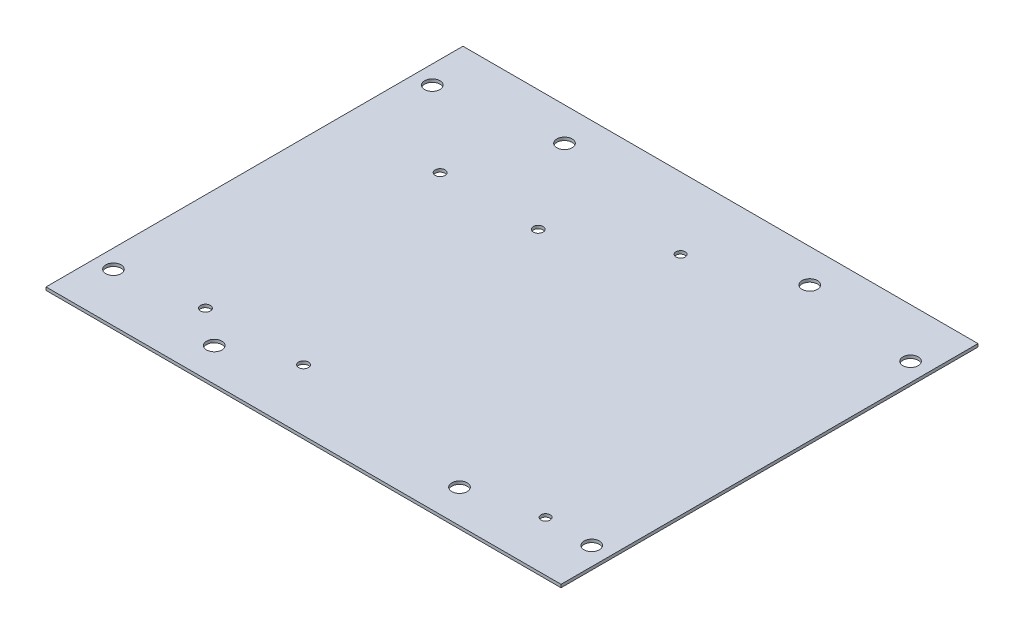
ISO-10303-21;
HEADER;
FILE_DESCRIPTION(('STEP AP214'),'2;1');
FILE_NAME('part.step','',(''),(''),'','','');
FILE_SCHEMA(('AUTOMOTIVE_DESIGN { 1 0 10303 214 1 1 1 1 }'));
ENDSEC;
DATA;
#1=APPLICATION_CONTEXT('core data for automotive mechanical design processes');
#2=APPLICATION_PROTOCOL_DEFINITION('international standard','automotive_design',2000,#1);
#3=PRODUCT_CONTEXT('',#1,'mechanical');
#4=PRODUCT('Part','Part','',(#3));
#5=PRODUCT_RELATED_PRODUCT_CATEGORY('part','',(#4));
#6=PRODUCT_DEFINITION_FORMATION('','',#4);
#7=PRODUCT_DEFINITION_CONTEXT('part definition',#1,'design');
#8=PRODUCT_DEFINITION('design','',#6,#7);
#9=PRODUCT_DEFINITION_SHAPE('','',#8);
#10=(LENGTH_UNIT() NAMED_UNIT(*) SI_UNIT(.MILLI.,.METRE.));
#11=(NAMED_UNIT(*) PLANE_ANGLE_UNIT() SI_UNIT($,.RADIAN.));
#12=(NAMED_UNIT(*) SI_UNIT($,.STERADIAN.) SOLID_ANGLE_UNIT());
#13=UNCERTAINTY_MEASURE_WITH_UNIT(LENGTH_MEASURE(1.E-05),#10,'distance_accuracy_value','');
#14=(GEOMETRIC_REPRESENTATION_CONTEXT(3) GLOBAL_UNCERTAINTY_ASSIGNED_CONTEXT((#13)) GLOBAL_UNIT_ASSIGNED_CONTEXT((#10,
#11,#12)) REPRESENTATION_CONTEXT('',''));
#15=CARTESIAN_POINT('',(0.,0.,0.));
#16=DIRECTION('',(0.,0.,1.));
#17=DIRECTION('',(1.,0.,0.));
#18=AXIS2_PLACEMENT_3D('',#15,#16,#17);
#19=CARTESIAN_POINT('',(133.35,-1.5748,107.95));
#20=DIRECTION('',(1.,0.,0.));
#21=DIRECTION('',(0.,0.,-1.));
#22=AXIS2_PLACEMENT_3D('',#19,#20,#21);
#23=PLANE('',#22);
#24=DIRECTION('',(0.,0.,-1.));
#25=VECTOR('',#24,1.);
#26=CARTESIAN_POINT('',(133.35,0.,107.95));
#27=LINE('',#26,#25);
#28=CARTESIAN_POINT('',(133.35,0.,107.95));
#29=VERTEX_POINT('',#28);
#30=CARTESIAN_POINT('',(133.35,0.,-107.95));
#31=VERTEX_POINT('',#30);
#32=EDGE_CURVE('E103',#29,#31,#27,.T.);
#33=ORIENTED_EDGE('',*,*,#32,.F.);
#34=DIRECTION('',(0.,1.,0.));
#35=VECTOR('',#34,1.);
#36=CARTESIAN_POINT('',(133.35,-1.5748,107.95));
#37=LINE('',#36,#35);
#38=CARTESIAN_POINT('',(133.35,-1.5748,107.95));
#39=VERTEX_POINT('',#38);
#40=EDGE_CURVE('E11',#39,#29,#37,.T.);
#41=ORIENTED_EDGE('',*,*,#40,.F.);
#42=DIRECTION('',(0.,0.,-1.));
#43=VECTOR('',#42,1.);
#44=CARTESIAN_POINT('',(133.35,-1.5748,107.95));
#45=LINE('',#44,#43);
#46=CARTESIAN_POINT('',(133.35,-1.5748,-107.95));
#47=VERTEX_POINT('',#46);
#48=EDGE_CURVE('E96',#39,#47,#45,.T.);
#49=ORIENTED_EDGE('',*,*,#48,.T.);
#50=DIRECTION('',(0.,1.,0.));
#51=VECTOR('',#50,1.);
#52=CARTESIAN_POINT('',(133.35,-1.5748,-107.95));
#53=LINE('',#52,#51);
#54=EDGE_CURVE('E41',#47,#31,#53,.T.);
#55=ORIENTED_EDGE('',*,*,#54,.T.);
#56=EDGE_LOOP('',(#33,#41,#49,#55));
#57=FACE_BOUND('',#56,.T.);
#58=ADVANCED_FACE('F38',(#57),#23,.T.);
#59=CARTESIAN_POINT('',(-133.35,-1.5748,107.95));
#60=DIRECTION('',(0.,0.,1.));
#61=DIRECTION('',(1.,0.,0.));
#62=AXIS2_PLACEMENT_3D('',#59,#60,#61);
#63=PLANE('',#62);
#64=DIRECTION('',(1.,0.,0.));
#65=VECTOR('',#64,1.);
#66=CARTESIAN_POINT('',(-133.35,0.,107.95));
#67=LINE('',#66,#65);
#68=CARTESIAN_POINT('',(-133.35,0.,107.95));
#69=VERTEX_POINT('',#68);
#70=EDGE_CURVE('E98',#69,#29,#67,.T.);
#71=ORIENTED_EDGE('',*,*,#70,.F.);
#72=DIRECTION('',(0.,1.,0.));
#73=VECTOR('',#72,1.);
#74=CARTESIAN_POINT('',(-133.35,-1.5748,107.95));
#75=LINE('',#74,#73);
#76=CARTESIAN_POINT('',(-133.35,-1.5748,107.95));
#77=VERTEX_POINT('',#76);
#78=EDGE_CURVE('E47',#77,#69,#75,.T.);
#79=ORIENTED_EDGE('',*,*,#78,.F.);
#80=DIRECTION('',(1.,0.,0.));
#81=VECTOR('',#80,1.);
#82=CARTESIAN_POINT('',(-133.35,-1.5748,107.95));
#83=LINE('',#82,#81);
#84=EDGE_CURVE('E93',#77,#39,#83,.T.);
#85=ORIENTED_EDGE('',*,*,#84,.T.);
#86=ORIENTED_EDGE('',*,*,#40,.T.);
#87=EDGE_LOOP('',(#71,#79,#85,#86));
#88=FACE_BOUND('',#87,.T.);
#89=ADVANCED_FACE('F114',(#88),#63,.T.);
#90=CARTESIAN_POINT('',(-133.35,-1.5748,107.95));
#91=DIRECTION('',(-1.,0.,0.));
#92=DIRECTION('',(0.,0.,1.));
#93=AXIS2_PLACEMENT_3D('',#90,#91,#92);
#94=PLANE('',#93);
#95=DIRECTION('',(0.,0.,1.));
#96=VECTOR('',#95,1.);
#97=CARTESIAN_POINT('',(-133.35,0.,107.95));
#98=LINE('',#97,#96);
#99=CARTESIAN_POINT('',(-133.35,0.,-107.95));
#100=VERTEX_POINT('',#99);
#101=EDGE_CURVE('E88',#100,#69,#98,.T.);
#102=ORIENTED_EDGE('',*,*,#101,.F.);
#103=DIRECTION('',(0.,1.,0.));
#104=VECTOR('',#103,1.);
#105=CARTESIAN_POINT('',(-133.35,-1.5748,-107.95));
#106=LINE('',#105,#104);
#107=CARTESIAN_POINT('',(-133.35,-1.5748,-107.95));
#108=VERTEX_POINT('',#107);
#109=EDGE_CURVE('E83',#108,#100,#106,.T.);
#110=ORIENTED_EDGE('',*,*,#109,.F.);
#111=DIRECTION('',(0.,0.,1.));
#112=VECTOR('',#111,1.);
#113=CARTESIAN_POINT('',(-133.35,-1.5748,107.95));
#114=LINE('',#113,#112);
#115=EDGE_CURVE('E86',#108,#77,#114,.T.);
#116=ORIENTED_EDGE('',*,*,#115,.T.);
#117=ORIENTED_EDGE('',*,*,#78,.T.);
#118=EDGE_LOOP('',(#102,#110,#116,#117));
#119=FACE_BOUND('',#118,.T.);
#120=ADVANCED_FACE('F85',(#119),#94,.T.);
#121=CARTESIAN_POINT('',(-133.35,-1.5748,-107.95));
#122=DIRECTION('',(0.,0.,-1.));
#123=DIRECTION('',(-1.,0.,0.));
#124=AXIS2_PLACEMENT_3D('',#121,#122,#123);
#125=PLANE('',#124);
#126=DIRECTION('',(-1.,0.,0.));
#127=VECTOR('',#126,1.);
#128=CARTESIAN_POINT('',(-133.35,0.,-107.95));
#129=LINE('',#128,#127);
#130=EDGE_CURVE('E106',#31,#100,#129,.T.);
#131=ORIENTED_EDGE('',*,*,#130,.F.);
#132=ORIENTED_EDGE('',*,*,#54,.F.);
#133=DIRECTION('',(-1.,0.,0.));
#134=VECTOR('',#133,1.);
#135=CARTESIAN_POINT('',(-133.35,-1.5748,-107.95));
#136=LINE('',#135,#134);
#137=EDGE_CURVE('E92',#47,#108,#136,.T.);
#138=ORIENTED_EDGE('',*,*,#137,.T.);
#139=ORIENTED_EDGE('',*,*,#109,.T.);
#140=EDGE_LOOP('',(#131,#132,#138,#139));
#141=FACE_BOUND('',#140,.T.);
#142=ADVANCED_FACE('F95',(#141),#125,.T.);
#143=CARTESIAN_POINT('',(0.,-1.5748,0.));
#144=DIRECTION('',(0.,-1.,0.));
#145=DIRECTION('',(0.,0.,-1.));
#146=AXIS2_PLACEMENT_3D('',#143,#144,#145);
#147=PLANE('',#146);
#148=CARTESIAN_POINT('',(99.35,-1.5748,81.95));
#149=DIRECTION('',(0.,1.,0.));
#150=DIRECTION('',(0.,0.,1.));
#151=AXIS2_PLACEMENT_3D('',#148,#149,#150);
#152=CIRCLE('',#151,2.38125);
#153=CARTESIAN_POINT('',(99.35,-1.5748,84.33125));
#154=VERTEX_POINT('',#153);
#155=EDGE_CURVE('E196',#154,#154,#152,.T.);
#156=ORIENTED_EDGE('',*,*,#155,.T.);
#157=EDGE_LOOP('',(#156));
#158=FACE_BOUND('',#157,.T.);
#159=CARTESIAN_POINT('',(16.35,-1.5748,-70.95));
#160=DIRECTION('',(0.,1.,0.));
#161=DIRECTION('',(0.,0.,1.));
#162=AXIS2_PLACEMENT_3D('',#159,#160,#161);
#163=CIRCLE('',#162,2.38125);
#164=CARTESIAN_POINT('',(16.35,-1.5748,-68.56875));
#165=VERTEX_POINT('',#164);
#166=EDGE_CURVE('E200',#165,#165,#163,.T.);
#167=ORIENTED_EDGE('',*,*,#166,.T.);
#168=EDGE_LOOP('',(#167));
#169=FACE_BOUND('',#168,.T.);
#170=CARTESIAN_POINT('',(-31.75,-1.5748,76.2));
#171=DIRECTION('',(0.,1.,0.));
#172=DIRECTION('',(0.,0.,1.));
#173=AXIS2_PLACEMENT_3D('',#170,#171,#172);
#174=CIRCLE('',#173,2.54);
#175=CARTESIAN_POINT('',(-31.75,-1.5748,78.74));
#176=VERTEX_POINT('',#175);
#177=EDGE_CURVE('E216',#176,#176,#174,.T.);
#178=ORIENTED_EDGE('',*,*,#177,.T.);
#179=EDGE_LOOP('',(#178));
#180=FACE_BOUND('',#179,.T.);
#181=CARTESIAN_POINT('',(-82.55,-1.5748,-45.339));
#182=DIRECTION('',(0.,1.,0.));
#183=DIRECTION('',(0.,0.,1.));
#184=AXIS2_PLACEMENT_3D('',#181,#182,#183);
#185=CIRCLE('',#184,2.54);
#186=CARTESIAN_POINT('',(-82.55,-1.5748,-42.799));
#187=VERTEX_POINT('',#186);
#188=EDGE_CURVE('E223',#187,#187,#185,.T.);
#189=ORIENTED_EDGE('',*,*,#188,.T.);
#190=EDGE_LOOP('',(#189));
#191=FACE_BOUND('',#190,.T.);
#192=CARTESIAN_POINT('',(-31.75,-1.5748,-45.339));
#193=DIRECTION('',(0.,1.,0.));
#194=DIRECTION('',(0.,0.,1.));
#195=AXIS2_PLACEMENT_3D('',#192,#193,#194);
#196=CIRCLE('',#195,2.54);
#197=CARTESIAN_POINT('',(-31.75,-1.5748,-42.799));
#198=VERTEX_POINT('',#197);
#199=EDGE_CURVE('E210',#198,#198,#196,.T.);
#200=ORIENTED_EDGE('',*,*,#199,.T.);
#201=EDGE_LOOP('',(#200));
#202=FACE_BOUND('',#201,.T.);
#203=CARTESIAN_POINT('',(-82.55,-1.5748,76.2));
#204=DIRECTION('',(0.,1.,0.));
#205=DIRECTION('',(0.,0.,1.));
#206=AXIS2_PLACEMENT_3D('',#203,#204,#205);
#207=CIRCLE('',#206,2.53999999999999);
#208=CARTESIAN_POINT('',(-82.55,-1.5748,78.74));
#209=VERTEX_POINT('',#208);
#210=EDGE_CURVE('E228',#209,#209,#207,.T.);
#211=ORIENTED_EDGE('',*,*,#210,.T.);
#212=EDGE_LOOP('',(#211));
#213=FACE_BOUND('',#212,.T.);
#214=CARTESIAN_POINT('',(-63.5,-1.5748,-90.678));
#215=DIRECTION('',(0.,-1.,0.));
#216=DIRECTION('',(0.,0.,-1.));
#217=AXIS2_PLACEMENT_3D('',#214,#215,#216);
#218=CIRCLE('',#217,3.96874999999999);
#219=CARTESIAN_POINT('',(-63.5,-1.5748,-94.64675));
#220=VERTEX_POINT('',#219);
#221=EDGE_CURVE('E234',#220,#220,#218,.T.);
#222=ORIENTED_EDGE('',*,*,#221,.F.);
#223=EDGE_LOOP('',(#222));
#224=FACE_BOUND('',#223,.T.);
#225=CARTESIAN_POINT('',(-123.825,-1.5748,-82.55));
#226=DIRECTION('',(0.,-1.,0.));
#227=DIRECTION('',(0.,0.,-1.));
#228=AXIS2_PLACEMENT_3D('',#225,#226,#227);
#229=CIRCLE('',#228,3.96874999999999);
#230=CARTESIAN_POINT('',(-123.825,-1.5748,-86.51875));
#231=VERTEX_POINT('',#230);
#232=EDGE_CURVE('E242',#231,#231,#229,.T.);
#233=ORIENTED_EDGE('',*,*,#232,.F.);
#234=EDGE_LOOP('',(#233));
#235=FACE_BOUND('',#234,.T.);
#236=CARTESIAN_POINT('',(63.5,-1.5748,-90.678));
#237=DIRECTION('',(0.,1.,0.));
#238=DIRECTION('',(0.,0.,-1.));
#239=AXIS2_PLACEMENT_3D('',#236,#237,#238);
#240=CIRCLE('',#239,3.96874999999999);
#241=CARTESIAN_POINT('',(63.5,-1.5748,-94.64675));
#242=VERTEX_POINT('',#241);
#243=EDGE_CURVE('E246',#242,#242,#240,.T.);
#244=ORIENTED_EDGE('',*,*,#243,.T.);
#245=EDGE_LOOP('',(#244));
#246=FACE_BOUND('',#245,.T.);
#247=CARTESIAN_POINT('',(123.825,-1.5748,-82.55));
#248=DIRECTION('',(0.,-1.,0.));
#249=DIRECTION('',(0.,0.,-1.));
#250=AXIS2_PLACEMENT_3D('',#247,#248,#249);
#251=CIRCLE('',#250,3.96874999999999);
#252=CARTESIAN_POINT('',(123.825,-1.5748,-86.51875));
#253=VERTEX_POINT('',#252);
#254=EDGE_CURVE('E254',#253,#253,#251,.F.);
#255=ORIENTED_EDGE('',*,*,#254,.T.);
#256=EDGE_LOOP('',(#255));
#257=FACE_BOUND('',#256,.T.);
#258=CARTESIAN_POINT('',(63.5,-1.5748,90.678));
#259=DIRECTION('',(0.,-1.,0.));
#260=DIRECTION('',(0.,0.,1.));
#261=AXIS2_PLACEMENT_3D('',#258,#259,#260);
#262=CIRCLE('',#261,3.96874999999999);
#263=CARTESIAN_POINT('',(63.5,-1.5748,94.64675));
#264=VERTEX_POINT('',#263);
#265=EDGE_CURVE('E258',#264,#264,#262,.T.);
#266=ORIENTED_EDGE('',*,*,#265,.F.);
#267=EDGE_LOOP('',(#266));
#268=FACE_BOUND('',#267,.T.);
#269=CARTESIAN_POINT('',(123.825,-1.5748,82.55));
#270=DIRECTION('',(0.,-1.,0.));
#271=DIRECTION('',(0.,0.,-1.));
#272=AXIS2_PLACEMENT_3D('',#269,#270,#271);
#273=CIRCLE('',#272,3.96874999999999);
#274=CARTESIAN_POINT('',(123.825,-1.5748,78.58125));
#275=VERTEX_POINT('',#274);
#276=EDGE_CURVE('E266',#275,#275,#273,.T.);
#277=ORIENTED_EDGE('',*,*,#276,.F.);
#278=EDGE_LOOP('',(#277));
#279=FACE_BOUND('',#278,.T.);
#280=CARTESIAN_POINT('',(-63.5,-1.5748,90.678));
#281=DIRECTION('',(0.,1.,0.));
#282=DIRECTION('',(0.,0.,1.));
#283=AXIS2_PLACEMENT_3D('',#280,#281,#282);
#284=CIRCLE('',#283,3.96874999999999);
#285=CARTESIAN_POINT('',(-63.5,-1.5748,94.64675));
#286=VERTEX_POINT('',#285);
#287=EDGE_CURVE('E270',#286,#286,#284,.T.);
#288=ORIENTED_EDGE('',*,*,#287,.T.);
#289=EDGE_LOOP('',(#288));
#290=FACE_BOUND('',#289,.T.);
#291=CARTESIAN_POINT('',(-123.825,-1.5748,82.55));
#292=DIRECTION('',(0.,-1.,0.));
#293=DIRECTION('',(0.,0.,-1.));
#294=AXIS2_PLACEMENT_3D('',#291,#292,#293);
#295=CIRCLE('',#294,3.96874999999999);
#296=CARTESIAN_POINT('',(-123.825,-1.5748,78.58125));
#297=VERTEX_POINT('',#296);
#298=EDGE_CURVE('E107',#297,#297,#295,.F.);
#299=ORIENTED_EDGE('',*,*,#298,.T.);
#300=EDGE_LOOP('',(#299));
#301=FACE_BOUND('',#300,.T.);
#302=ORIENTED_EDGE('',*,*,#48,.F.);
#303=ORIENTED_EDGE('',*,*,#84,.F.);
#304=ORIENTED_EDGE('',*,*,#115,.F.);
#305=ORIENTED_EDGE('',*,*,#137,.F.);
#306=EDGE_LOOP('',(#302,#303,#304,#305));
#307=FACE_BOUND('',#306,.T.);
#308=ADVANCED_FACE('F91',(#158,#169,#180,#191,#202,#213,#224,#235,#246,#257,#268,#279,#290,#301,
#307),#147,.T.);
#309=CARTESIAN_POINT('',(0.,0.,0.));
#310=DIRECTION('',(0.,-1.,0.));
#311=DIRECTION('',(0.,0.,-1.));
#312=AXIS2_PLACEMENT_3D('',#309,#310,#311);
#313=PLANE('',#312);
#314=CARTESIAN_POINT('',(99.35,0.,81.95));
#315=DIRECTION('',(0.,1.,0.));
#316=DIRECTION('',(0.,0.,1.));
#317=AXIS2_PLACEMENT_3D('',#314,#315,#316);
#318=CIRCLE('',#317,2.38125);
#319=CARTESIAN_POINT('',(99.35,0.,84.33125));
#320=VERTEX_POINT('',#319);
#321=EDGE_CURVE('E199',#320,#320,#318,.T.);
#322=ORIENTED_EDGE('',*,*,#321,.F.);
#323=EDGE_LOOP('',(#322));
#324=FACE_BOUND('',#323,.T.);
#325=CARTESIAN_POINT('',(16.35,0.,-70.95));
#326=DIRECTION('',(0.,1.,0.));
#327=DIRECTION('',(0.,0.,1.));
#328=AXIS2_PLACEMENT_3D('',#325,#326,#327);
#329=CIRCLE('',#328,2.38125);
#330=CARTESIAN_POINT('',(16.35,0.,-68.56875));
#331=VERTEX_POINT('',#330);
#332=EDGE_CURVE('E205',#331,#331,#329,.T.);
#333=ORIENTED_EDGE('',*,*,#332,.F.);
#334=EDGE_LOOP('',(#333));
#335=FACE_BOUND('',#334,.T.);
#336=CARTESIAN_POINT('',(-31.75,0.,76.2));
#337=DIRECTION('',(0.,1.,0.));
#338=DIRECTION('',(0.,0.,1.));
#339=AXIS2_PLACEMENT_3D('',#336,#337,#338);
#340=CIRCLE('',#339,2.54);
#341=CARTESIAN_POINT('',(-31.75,0.,78.74));
#342=VERTEX_POINT('',#341);
#343=EDGE_CURVE('E220',#342,#342,#340,.T.);
#344=ORIENTED_EDGE('',*,*,#343,.F.);
#345=EDGE_LOOP('',(#344));
#346=FACE_BOUND('',#345,.T.);
#347=CARTESIAN_POINT('',(-82.55,0.,-45.339));
#348=DIRECTION('',(0.,1.,0.));
#349=DIRECTION('',(0.,0.,1.));
#350=AXIS2_PLACEMENT_3D('',#347,#348,#349);
#351=CIRCLE('',#350,2.54);
#352=CARTESIAN_POINT('',(-82.55,0.,-42.799));
#353=VERTEX_POINT('',#352);
#354=EDGE_CURVE('E213',#353,#353,#351,.T.);
#355=ORIENTED_EDGE('',*,*,#354,.F.);
#356=EDGE_LOOP('',(#355));
#357=FACE_BOUND('',#356,.T.);
#358=CARTESIAN_POINT('',(-31.75,0.,-45.339));
#359=DIRECTION('',(0.,1.,0.));
#360=DIRECTION('',(0.,0.,1.));
#361=AXIS2_PLACEMENT_3D('',#358,#359,#360);
#362=CIRCLE('',#361,2.54);
#363=CARTESIAN_POINT('',(-31.75,0.,-42.799));
#364=VERTEX_POINT('',#363);
#365=EDGE_CURVE('E202',#364,#364,#362,.T.);
#366=ORIENTED_EDGE('',*,*,#365,.F.);
#367=EDGE_LOOP('',(#366));
#368=FACE_BOUND('',#367,.T.);
#369=CARTESIAN_POINT('',(-82.55,0.,76.2));
#370=DIRECTION('',(0.,1.,0.));
#371=DIRECTION('',(0.,0.,1.));
#372=AXIS2_PLACEMENT_3D('',#369,#370,#371);
#373=CIRCLE('',#372,2.53999999999999);
#374=CARTESIAN_POINT('',(-82.55,0.,78.74));
#375=VERTEX_POINT('',#374);
#376=EDGE_CURVE('E219',#375,#375,#373,.T.);
#377=ORIENTED_EDGE('',*,*,#376,.F.);
#378=EDGE_LOOP('',(#377));
#379=FACE_BOUND('',#378,.T.);
#380=CARTESIAN_POINT('',(-63.5,0.,-90.678));
#381=DIRECTION('',(0.,-1.,0.));
#382=DIRECTION('',(0.,0.,-1.));
#383=AXIS2_PLACEMENT_3D('',#380,#381,#382);
#384=CIRCLE('',#383,3.96874999999999);
#385=CARTESIAN_POINT('',(-63.5,0.,-94.64675));
#386=VERTEX_POINT('',#385);
#387=EDGE_CURVE('E231',#386,#386,#384,.T.);
#388=ORIENTED_EDGE('',*,*,#387,.T.);
#389=EDGE_LOOP('',(#388));
#390=FACE_BOUND('',#389,.T.);
#391=CARTESIAN_POINT('',(-123.825,0.,-82.55));
#392=DIRECTION('',(0.,-1.,0.));
#393=DIRECTION('',(0.,0.,-1.));
#394=AXIS2_PLACEMENT_3D('',#391,#392,#393);
#395=CIRCLE('',#394,3.96874999999999);
#396=CARTESIAN_POINT('',(-123.825,0.,-86.51875));
#397=VERTEX_POINT('',#396);
#398=EDGE_CURVE('E237',#397,#397,#395,.T.);
#399=ORIENTED_EDGE('',*,*,#398,.T.);
#400=EDGE_LOOP('',(#399));
#401=FACE_BOUND('',#400,.T.);
#402=CARTESIAN_POINT('',(63.5,0.,-90.678));
#403=DIRECTION('',(0.,1.,0.));
#404=DIRECTION('',(0.,0.,-1.));
#405=AXIS2_PLACEMENT_3D('',#402,#403,#404);
#406=CIRCLE('',#405,3.96874999999999);
#407=CARTESIAN_POINT('',(63.5,0.,-94.64675));
#408=VERTEX_POINT('',#407);
#409=EDGE_CURVE('E245',#408,#408,#406,.T.);
#410=ORIENTED_EDGE('',*,*,#409,.F.);
#411=EDGE_LOOP('',(#410));
#412=FACE_BOUND('',#411,.T.);
#413=CARTESIAN_POINT('',(123.825,0.,-82.55));
#414=DIRECTION('',(0.,1.,0.));
#415=DIRECTION('',(0.,0.,-1.));
#416=AXIS2_PLACEMENT_3D('',#413,#414,#415);
#417=CIRCLE('',#416,3.96874999999999);
#418=CARTESIAN_POINT('',(123.825,0.,-86.51875));
#419=VERTEX_POINT('',#418);
#420=EDGE_CURVE('E249',#419,#419,#417,.T.);
#421=ORIENTED_EDGE('',*,*,#420,.F.);
#422=EDGE_LOOP('',(#421));
#423=FACE_BOUND('',#422,.T.);
#424=CARTESIAN_POINT('',(63.5,0.,90.678));
#425=DIRECTION('',(0.,-1.,0.));
#426=DIRECTION('',(0.,0.,1.));
#427=AXIS2_PLACEMENT_3D('',#424,#425,#426);
#428=CIRCLE('',#427,3.96874999999999);
#429=CARTESIAN_POINT('',(63.5,0.,94.64675));
#430=VERTEX_POINT('',#429);
#431=EDGE_CURVE('E257',#430,#430,#428,.T.);
#432=ORIENTED_EDGE('',*,*,#431,.T.);
#433=EDGE_LOOP('',(#432));
#434=FACE_BOUND('',#433,.T.);
#435=CARTESIAN_POINT('',(123.825,0.,82.55));
#436=DIRECTION('',(0.,-1.,0.));
#437=DIRECTION('',(0.,0.,1.));
#438=AXIS2_PLACEMENT_3D('',#435,#436,#437);
#439=CIRCLE('',#438,3.96874999999999);
#440=CARTESIAN_POINT('',(123.825,0.,86.51875));
#441=VERTEX_POINT('',#440);
#442=EDGE_CURVE('E261',#441,#441,#439,.T.);
#443=ORIENTED_EDGE('',*,*,#442,.T.);
#444=EDGE_LOOP('',(#443));
#445=FACE_BOUND('',#444,.T.);
#446=CARTESIAN_POINT('',(-63.5,0.,90.678));
#447=DIRECTION('',(0.,1.,0.));
#448=DIRECTION('',(0.,0.,1.));
#449=AXIS2_PLACEMENT_3D('',#446,#447,#448);
#450=CIRCLE('',#449,3.96874999999999);
#451=CARTESIAN_POINT('',(-63.5,0.,94.64675));
#452=VERTEX_POINT('',#451);
#453=EDGE_CURVE('E269',#452,#452,#450,.T.);
#454=ORIENTED_EDGE('',*,*,#453,.F.);
#455=EDGE_LOOP('',(#454));
#456=FACE_BOUND('',#455,.T.);
#457=CARTESIAN_POINT('',(-123.825,0.,82.55));
#458=DIRECTION('',(0.,1.,0.));
#459=DIRECTION('',(0.,0.,1.));
#460=AXIS2_PLACEMENT_3D('',#457,#458,#459);
#461=CIRCLE('',#460,3.96874999999999);
#462=CARTESIAN_POINT('',(-123.825,0.,86.51875));
#463=VERTEX_POINT('',#462);
#464=EDGE_CURVE('E273',#463,#463,#461,.T.);
#465=ORIENTED_EDGE('',*,*,#464,.F.);
#466=EDGE_LOOP('',(#465));
#467=FACE_BOUND('',#466,.T.);
#468=ORIENTED_EDGE('',*,*,#32,.T.);
#469=ORIENTED_EDGE('',*,*,#130,.T.);
#470=ORIENTED_EDGE('',*,*,#101,.T.);
#471=ORIENTED_EDGE('',*,*,#70,.T.);
#472=EDGE_LOOP('',(#468,#469,#470,#471));
#473=FACE_BOUND('',#472,.T.);
#474=ADVANCED_FACE('F113',(#324,#335,#346,#357,#368,#379,#390,#401,#412,#423,#434,#445,#456,
#467,#473),#313,.F.);
#475=CARTESIAN_POINT('',(-123.825,-12.8001201513364,82.55));
#476=DIRECTION('',(0.,1.,0.));
#477=DIRECTION('',(0.,0.,1.));
#478=AXIS2_PLACEMENT_3D('',#475,#476,#477);
#479=CYLINDRICAL_SURFACE('',#478,3.96874999999999);
#480=ORIENTED_EDGE('',*,*,#464,.T.);
#481=EDGE_LOOP('',(#480));
#482=FACE_BOUND('',#481,.T.);
#483=ORIENTED_EDGE('',*,*,#298,.F.);
#484=EDGE_LOOP('',(#483));
#485=FACE_BOUND('',#484,.T.);
#486=ADVANCED_FACE('F133',(#482,#485),#479,.F.);
#487=CARTESIAN_POINT('',(-63.5,-1.5748,90.678));
#488=DIRECTION('',(0.,1.,0.));
#489=DIRECTION('',(0.,0.,1.));
#490=AXIS2_PLACEMENT_3D('',#487,#488,#489);
#491=CYLINDRICAL_SURFACE('',#490,3.96874999999999);
#492=ORIENTED_EDGE('',*,*,#287,.F.);
#493=EDGE_LOOP('',(#492));
#494=FACE_BOUND('',#493,.T.);
#495=ORIENTED_EDGE('',*,*,#453,.T.);
#496=EDGE_LOOP('',(#495));
#497=FACE_BOUND('',#496,.T.);
#498=ADVANCED_FACE('F140',(#494,#497),#491,.F.);
#499=CARTESIAN_POINT('',(123.825,-12.8001201513364,82.55));
#500=DIRECTION('',(0.,1.,0.));
#501=DIRECTION('',(0.,0.,1.));
#502=AXIS2_PLACEMENT_3D('',#499,#500,#501);
#503=CYLINDRICAL_SURFACE('',#502,3.96874999999999);
#504=ORIENTED_EDGE('',*,*,#442,.F.);
#505=EDGE_LOOP('',(#504));
#506=FACE_BOUND('',#505,.T.);
#507=ORIENTED_EDGE('',*,*,#276,.T.);
#508=EDGE_LOOP('',(#507));
#509=FACE_BOUND('',#508,.T.);
#510=ADVANCED_FACE('F144',(#506,#509),#503,.F.);
#511=CARTESIAN_POINT('',(63.5,-1.5748,90.678));
#512=DIRECTION('',(0.,1.,0.));
#513=DIRECTION('',(0.,0.,1.));
#514=AXIS2_PLACEMENT_3D('',#511,#512,#513);
#515=CYLINDRICAL_SURFACE('',#514,3.96874999999999);
#516=ORIENTED_EDGE('',*,*,#265,.T.);
#517=EDGE_LOOP('',(#516));
#518=FACE_BOUND('',#517,.T.);
#519=ORIENTED_EDGE('',*,*,#431,.F.);
#520=EDGE_LOOP('',(#519));
#521=FACE_BOUND('',#520,.T.);
#522=ADVANCED_FACE('F148',(#518,#521),#515,.F.);
#523=CARTESIAN_POINT('',(123.825,-12.8001201513364,-82.55));
#524=DIRECTION('',(0.,1.,0.));
#525=DIRECTION('',(0.,0.,1.));
#526=AXIS2_PLACEMENT_3D('',#523,#524,#525);
#527=CYLINDRICAL_SURFACE('',#526,3.96874999999999);
#528=ORIENTED_EDGE('',*,*,#420,.T.);
#529=EDGE_LOOP('',(#528));
#530=FACE_BOUND('',#529,.T.);
#531=ORIENTED_EDGE('',*,*,#254,.F.);
#532=EDGE_LOOP('',(#531));
#533=FACE_BOUND('',#532,.T.);
#534=ADVANCED_FACE('F152',(#530,#533),#527,.F.);
#535=CARTESIAN_POINT('',(63.5,-1.5748,-90.678));
#536=DIRECTION('',(0.,1.,0.));
#537=DIRECTION('',(0.,0.,1.));
#538=AXIS2_PLACEMENT_3D('',#535,#536,#537);
#539=CYLINDRICAL_SURFACE('',#538,3.96874999999999);
#540=ORIENTED_EDGE('',*,*,#243,.F.);
#541=EDGE_LOOP('',(#540));
#542=FACE_BOUND('',#541,.T.);
#543=ORIENTED_EDGE('',*,*,#409,.T.);
#544=EDGE_LOOP('',(#543));
#545=FACE_BOUND('',#544,.T.);
#546=ADVANCED_FACE('F156',(#542,#545),#539,.F.);
#547=CARTESIAN_POINT('',(-123.825,-12.8001201513364,-82.55));
#548=DIRECTION('',(0.,1.,0.));
#549=DIRECTION('',(0.,0.,1.));
#550=AXIS2_PLACEMENT_3D('',#547,#548,#549);
#551=CYLINDRICAL_SURFACE('',#550,3.96874999999999);
#552=ORIENTED_EDGE('',*,*,#398,.F.);
#553=EDGE_LOOP('',(#552));
#554=FACE_BOUND('',#553,.T.);
#555=ORIENTED_EDGE('',*,*,#232,.T.);
#556=EDGE_LOOP('',(#555));
#557=FACE_BOUND('',#556,.T.);
#558=ADVANCED_FACE('F160',(#554,#557),#551,.F.);
#559=CARTESIAN_POINT('',(-63.5,-1.5748,-90.678));
#560=DIRECTION('',(0.,1.,0.));
#561=DIRECTION('',(0.,0.,1.));
#562=AXIS2_PLACEMENT_3D('',#559,#560,#561);
#563=CYLINDRICAL_SURFACE('',#562,3.96874999999999);
#564=ORIENTED_EDGE('',*,*,#221,.T.);
#565=EDGE_LOOP('',(#564));
#566=FACE_BOUND('',#565,.T.);
#567=ORIENTED_EDGE('',*,*,#387,.F.);
#568=EDGE_LOOP('',(#567));
#569=FACE_BOUND('',#568,.T.);
#570=ADVANCED_FACE('F164',(#566,#569),#563,.F.);
#571=CARTESIAN_POINT('',(-82.55,-1.5748,76.2));
#572=DIRECTION('',(0.,1.,0.));
#573=DIRECTION('',(0.,0.,1.));
#574=AXIS2_PLACEMENT_3D('',#571,#572,#573);
#575=CYLINDRICAL_SURFACE('',#574,2.53999999999999);
#576=ORIENTED_EDGE('',*,*,#210,.F.);
#577=EDGE_LOOP('',(#576));
#578=FACE_BOUND('',#577,.T.);
#579=ORIENTED_EDGE('',*,*,#376,.T.);
#580=EDGE_LOOP('',(#579));
#581=FACE_BOUND('',#580,.T.);
#582=ADVANCED_FACE('F168',(#578,#581),#575,.F.);
#583=CARTESIAN_POINT('',(-31.75,-1.5748,-45.339));
#584=DIRECTION('',(0.,1.,0.));
#585=DIRECTION('',(0.,0.,1.));
#586=AXIS2_PLACEMENT_3D('',#583,#584,#585);
#587=CYLINDRICAL_SURFACE('',#586,2.54);
#588=ORIENTED_EDGE('',*,*,#199,.F.);
#589=EDGE_LOOP('',(#588));
#590=FACE_BOUND('',#589,.T.);
#591=ORIENTED_EDGE('',*,*,#365,.T.);
#592=EDGE_LOOP('',(#591));
#593=FACE_BOUND('',#592,.T.);
#594=ADVANCED_FACE('F172',(#590,#593),#587,.F.);
#595=CARTESIAN_POINT('',(-82.55,-1.5748,-45.339));
#596=DIRECTION('',(0.,1.,0.));
#597=DIRECTION('',(0.,0.,1.));
#598=AXIS2_PLACEMENT_3D('',#595,#596,#597);
#599=CYLINDRICAL_SURFACE('',#598,2.54);
#600=ORIENTED_EDGE('',*,*,#188,.F.);
#601=EDGE_LOOP('',(#600));
#602=FACE_BOUND('',#601,.T.);
#603=ORIENTED_EDGE('',*,*,#354,.T.);
#604=EDGE_LOOP('',(#603));
#605=FACE_BOUND('',#604,.T.);
#606=ADVANCED_FACE('F174',(#602,#605),#599,.F.);
#607=CARTESIAN_POINT('',(-31.75,-1.5748,76.2));
#608=DIRECTION('',(0.,1.,0.));
#609=DIRECTION('',(0.,0.,1.));
#610=AXIS2_PLACEMENT_3D('',#607,#608,#609);
#611=CYLINDRICAL_SURFACE('',#610,2.54);
#612=ORIENTED_EDGE('',*,*,#177,.F.);
#613=EDGE_LOOP('',(#612));
#614=FACE_BOUND('',#613,.T.);
#615=ORIENTED_EDGE('',*,*,#343,.T.);
#616=EDGE_LOOP('',(#615));
#617=FACE_BOUND('',#616,.T.);
#618=ADVANCED_FACE('F177',(#614,#617),#611,.F.);
#619=CARTESIAN_POINT('',(16.35,-1.5748,-70.95));
#620=DIRECTION('',(0.,1.,0.));
#621=DIRECTION('',(0.,0.,1.));
#622=AXIS2_PLACEMENT_3D('',#619,#620,#621);
#623=CYLINDRICAL_SURFACE('',#622,2.38125);
#624=ORIENTED_EDGE('',*,*,#166,.F.);
#625=EDGE_LOOP('',(#624));
#626=FACE_BOUND('',#625,.T.);
#627=ORIENTED_EDGE('',*,*,#332,.T.);
#628=EDGE_LOOP('',(#627));
#629=FACE_BOUND('',#628,.T.);
#630=ADVANCED_FACE('F181',(#626,#629),#623,.F.);
#631=CARTESIAN_POINT('',(99.35,-1.5748,81.95));
#632=DIRECTION('',(0.,1.,0.));
#633=DIRECTION('',(0.,0.,1.));
#634=AXIS2_PLACEMENT_3D('',#631,#632,#633);
#635=CYLINDRICAL_SURFACE('',#634,2.38125);
#636=ORIENTED_EDGE('',*,*,#155,.F.);
#637=EDGE_LOOP('',(#636));
#638=FACE_BOUND('',#637,.T.);
#639=ORIENTED_EDGE('',*,*,#321,.T.);
#640=EDGE_LOOP('',(#639));
#641=FACE_BOUND('',#640,.T.);
#642=ADVANCED_FACE('F188',(#638,#641),#635,.F.);
#643=CLOSED_SHELL('',(#58,#89,#120,#142,#308,#474,#486,#498,#510,#522,#534,#546,#558,#570,#582,
#594,#606,#618,#630,#642));
#644=MANIFOLD_SOLID_BREP('B2',#643);
#645=ADVANCED_BREP_SHAPE_REPRESENTATION('',(#18,#644),#14);
#646=SHAPE_DEFINITION_REPRESENTATION(#9,#645);
ENDSEC;
END-ISO-10303-21;
